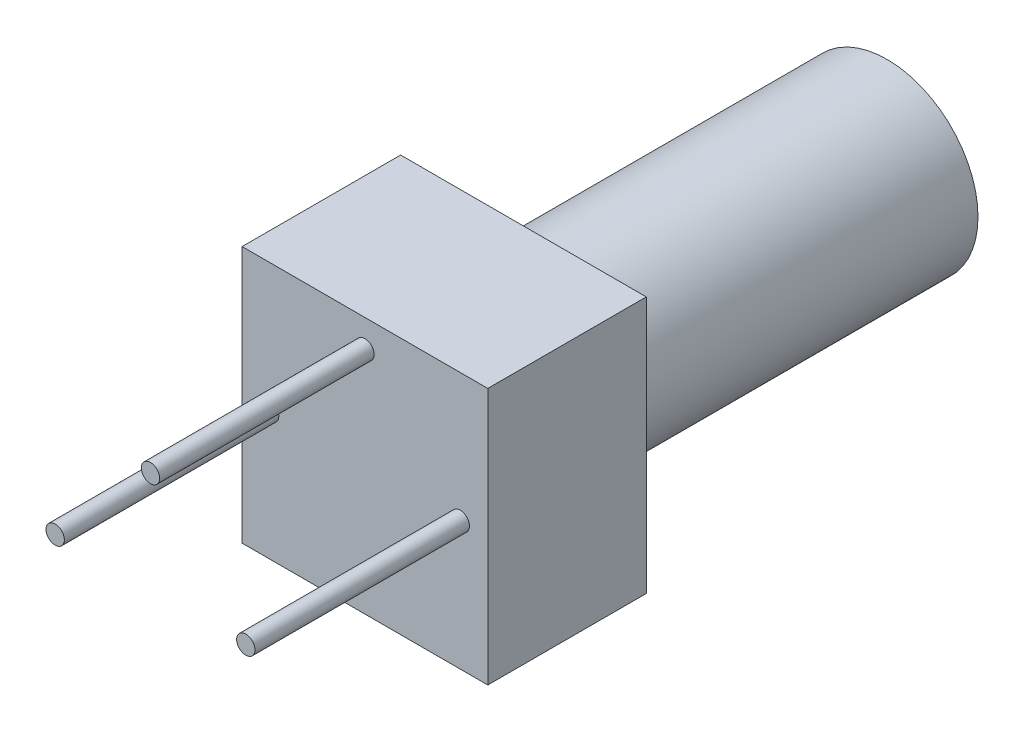
ISO-10303-21;
HEADER;
FILE_DESCRIPTION(('STEP AP214'),'2;1');
FILE_NAME('part.step','',(''),(''),'','','');
FILE_SCHEMA(('AUTOMOTIVE_DESIGN { 1 0 10303 214 1 1 1 1 }'));
ENDSEC;
DATA;
#1=APPLICATION_CONTEXT('core data for automotive mechanical design processes');
#2=APPLICATION_PROTOCOL_DEFINITION('international standard','automotive_design',2000,#1);
#3=PRODUCT_CONTEXT('',#1,'mechanical');
#4=PRODUCT('Part','Part','',(#3));
#5=PRODUCT_RELATED_PRODUCT_CATEGORY('part','',(#4));
#6=PRODUCT_DEFINITION_FORMATION('','',#4);
#7=PRODUCT_DEFINITION_CONTEXT('part definition',#1,'design');
#8=PRODUCT_DEFINITION('design','',#6,#7);
#9=PRODUCT_DEFINITION_SHAPE('','',#8);
#10=(LENGTH_UNIT() NAMED_UNIT(*) SI_UNIT(.MILLI.,.METRE.));
#11=(NAMED_UNIT(*) PLANE_ANGLE_UNIT() SI_UNIT($,.RADIAN.));
#12=(NAMED_UNIT(*) SI_UNIT($,.STERADIAN.) SOLID_ANGLE_UNIT());
#13=UNCERTAINTY_MEASURE_WITH_UNIT(LENGTH_MEASURE(1.E-05),#10,'distance_accuracy_value','');
#14=(GEOMETRIC_REPRESENTATION_CONTEXT(3) GLOBAL_UNCERTAINTY_ASSIGNED_CONTEXT((#13)) GLOBAL_UNIT_ASSIGNED_CONTEXT((#10,
#11,#12)) REPRESENTATION_CONTEXT('',''));
#15=CARTESIAN_POINT('',(0.,0.,0.));
#16=DIRECTION('',(0.,0.,1.));
#17=DIRECTION('',(1.,0.,0.));
#18=AXIS2_PLACEMENT_3D('',#15,#16,#17);
#19=CARTESIAN_POINT('',(2.59645,0.,48.66));
#20=DIRECTION('',(0.,0.,-1.));
#21=DIRECTION('',(-1.,0.,0.));
#22=AXIS2_PLACEMENT_3D('',#19,#20,#21);
#23=CYLINDRICAL_SURFACE('',#22,0.25);
#24=CARTESIAN_POINT('',(2.59645,0.,48.66));
#25=DIRECTION('',(0.,0.,-1.));
#26=DIRECTION('',(1.,0.,0.));
#27=AXIS2_PLACEMENT_3D('',#24,#25,#26);
#28=CIRCLE('',#27,0.25);
#29=CARTESIAN_POINT('',(2.84645,0.,48.66));
#30=VERTEX_POINT('',#29);
#31=EDGE_CURVE('E11',#30,#30,#28,.T.);
#32=ORIENTED_EDGE('',*,*,#31,.T.);
#33=EDGE_LOOP('',(#32));
#34=FACE_BOUND('',#33,.T.);
#35=CARTESIAN_POINT('',(2.59645,0.,42.818));
#36=DIRECTION('',(0.,0.,-1.));
#37=DIRECTION('',(1.,0.,0.));
#38=AXIS2_PLACEMENT_3D('',#35,#36,#37);
#39=CIRCLE('',#38,0.25);
#40=CARTESIAN_POINT('',(2.84645,0.,42.818));
#41=VERTEX_POINT('',#40);
#42=EDGE_CURVE('E43',#41,#41,#39,.T.);
#43=ORIENTED_EDGE('',*,*,#42,.F.);
#44=EDGE_LOOP('',(#43));
#45=FACE_BOUND('',#44,.T.);
#46=ADVANCED_FACE('F40',(#34,#45),#23,.T.);
#47=CARTESIAN_POINT('',(2.59645,0.,48.66));
#48=DIRECTION('',(0.,0.,1.));
#49=DIRECTION('',(1.,0.,0.));
#50=AXIS2_PLACEMENT_3D('',#47,#48,#49);
#51=PLANE('',#50);
#52=ORIENTED_EDGE('',*,*,#31,.F.);
#53=EDGE_LOOP('',(#52));
#54=FACE_BOUND('',#53,.T.);
#55=ADVANCED_FACE('F55',(#54),#51,.T.);
#56=CARTESIAN_POINT('',(2.59645,0.,42.818));
#57=DIRECTION('',(0.,0.,1.));
#58=DIRECTION('',(1.,0.,0.));
#59=AXIS2_PLACEMENT_3D('',#56,#57,#58);
#60=PLANE('',#59);
#61=ORIENTED_EDGE('',*,*,#42,.T.);
#62=EDGE_LOOP('',(#61));
#63=FACE_BOUND('',#62,.T.);
#64=ADVANCED_FACE('F52',(#63),#60,.F.);
#65=CLOSED_SHELL('',(#46,#55,#64));
#66=MANIFOLD_SOLID_BREP('B2',#65);
#67=CARTESIAN_POINT('',(-2.59645,0.,48.66));
#68=DIRECTION('',(0.,0.,-1.));
#69=DIRECTION('',(-1.,0.,0.));
#70=AXIS2_PLACEMENT_3D('',#67,#68,#69);
#71=CYLINDRICAL_SURFACE('',#70,0.25);
#72=CARTESIAN_POINT('',(-2.59645,0.,48.66));
#73=DIRECTION('',(0.,0.,-1.));
#74=DIRECTION('',(-1.,0.,0.));
#75=AXIS2_PLACEMENT_3D('',#72,#73,#74);
#76=CIRCLE('',#75,0.25);
#77=CARTESIAN_POINT('',(-2.84645,0.,48.66));
#78=VERTEX_POINT('',#77);
#79=EDGE_CURVE('E39',#78,#78,#76,.T.);
#80=ORIENTED_EDGE('',*,*,#79,.T.);
#81=EDGE_LOOP('',(#80));
#82=FACE_BOUND('',#81,.T.);
#83=CARTESIAN_POINT('',(-2.59645,0.,42.818));
#84=DIRECTION('',(0.,0.,-1.));
#85=DIRECTION('',(-1.,0.,0.));
#86=AXIS2_PLACEMENT_3D('',#83,#84,#85);
#87=CIRCLE('',#86,0.25);
#88=CARTESIAN_POINT('',(-2.84645,0.,42.818));
#89=VERTEX_POINT('',#88);
#90=EDGE_CURVE('E92',#89,#89,#87,.T.);
#91=ORIENTED_EDGE('',*,*,#90,.F.);
#92=EDGE_LOOP('',(#91));
#93=FACE_BOUND('',#92,.T.);
#94=ADVANCED_FACE('F89',(#82,#93),#71,.T.);
#95=CARTESIAN_POINT('',(-2.59645,0.,48.66));
#96=DIRECTION('',(0.,0.,-1.));
#97=DIRECTION('',(-1.,0.,0.));
#98=AXIS2_PLACEMENT_3D('',#95,#96,#97);
#99=PLANE('',#98);
#100=ORIENTED_EDGE('',*,*,#79,.F.);
#101=EDGE_LOOP('',(#100));
#102=FACE_BOUND('',#101,.T.);
#103=ADVANCED_FACE('F104',(#102),#99,.F.);
#104=CARTESIAN_POINT('',(-2.59645,0.,42.818));
#105=DIRECTION('',(0.,0.,-1.));
#106=DIRECTION('',(-1.,0.,0.));
#107=AXIS2_PLACEMENT_3D('',#104,#105,#106);
#108=PLANE('',#107);
#109=ORIENTED_EDGE('',*,*,#90,.T.);
#110=EDGE_LOOP('',(#109));
#111=FACE_BOUND('',#110,.T.);
#112=ADVANCED_FACE('F101',(#111),#108,.T.);
#113=CLOSED_SHELL('',(#94,#103,#112));
#114=MANIFOLD_SOLID_BREP('B6',#113);
#115=CARTESIAN_POINT('',(0.,2.74885,48.66));
#116=DIRECTION('',(0.,0.,-1.));
#117=DIRECTION('',(-1.,0.,0.));
#118=AXIS2_PLACEMENT_3D('',#115,#116,#117);
#119=CYLINDRICAL_SURFACE('',#118,0.25);
#120=CARTESIAN_POINT('',(0.,2.74885,48.66));
#121=DIRECTION('',(0.,0.,-1.));
#122=DIRECTION('',(-1.,0.,0.));
#123=AXIS2_PLACEMENT_3D('',#120,#121,#122);
#124=CIRCLE('',#123,0.25);
#125=CARTESIAN_POINT('',(-0.25,2.74885,48.66));
#126=VERTEX_POINT('',#125);
#127=EDGE_CURVE('E88',#126,#126,#124,.T.);
#128=ORIENTED_EDGE('',*,*,#127,.T.);
#129=EDGE_LOOP('',(#128));
#130=FACE_BOUND('',#129,.T.);
#131=CARTESIAN_POINT('',(0.,2.74885,42.818));
#132=DIRECTION('',(0.,0.,-1.));
#133=DIRECTION('',(-1.,0.,0.));
#134=AXIS2_PLACEMENT_3D('',#131,#132,#133);
#135=CIRCLE('',#134,0.25);
#136=CARTESIAN_POINT('',(-0.25,2.74885,42.818));
#137=VERTEX_POINT('',#136);
#138=EDGE_CURVE('E142',#137,#137,#135,.T.);
#139=ORIENTED_EDGE('',*,*,#138,.F.);
#140=EDGE_LOOP('',(#139));
#141=FACE_BOUND('',#140,.T.);
#142=ADVANCED_FACE('F139',(#130,#141),#119,.T.);
#143=CARTESIAN_POINT('',(0.,2.74885,48.66));
#144=DIRECTION('',(0.,0.,-1.));
#145=DIRECTION('',(-1.,0.,0.));
#146=AXIS2_PLACEMENT_3D('',#143,#144,#145);
#147=PLANE('',#146);
#148=ORIENTED_EDGE('',*,*,#127,.F.);
#149=EDGE_LOOP('',(#148));
#150=FACE_BOUND('',#149,.T.);
#151=ADVANCED_FACE('F154',(#150),#147,.F.);
#152=CARTESIAN_POINT('',(0.,2.74885,42.818));
#153=DIRECTION('',(0.,0.,-1.));
#154=DIRECTION('',(-1.,0.,0.));
#155=AXIS2_PLACEMENT_3D('',#152,#153,#154);
#156=PLANE('',#155);
#157=ORIENTED_EDGE('',*,*,#138,.T.);
#158=EDGE_LOOP('',(#157));
#159=FACE_BOUND('',#158,.T.);
#160=ADVANCED_FACE('F151',(#159),#156,.T.);
#161=CLOSED_SHELL('',(#142,#151,#160));
#162=MANIFOLD_SOLID_BREP('B34',#161);
#163=CARTESIAN_POINT('',(3.34645,-3.49885,42.818));
#164=DIRECTION('',(-1.,0.,0.));
#165=DIRECTION('',(0.,0.,1.));
#166=AXIS2_PLACEMENT_3D('',#163,#164,#165);
#167=PLANE('',#166);
#168=DIRECTION('',(0.,1.,0.));
#169=VECTOR('',#168,1.);
#170=CARTESIAN_POINT('',(3.34645,-3.49885,38.5));
#171=LINE('',#170,#169);
#172=CARTESIAN_POINT('',(3.34645,-3.49885,38.5));
#173=VERTEX_POINT('',#172);
#174=CARTESIAN_POINT('',(3.34645,3.49885,38.5));
#175=VERTEX_POINT('',#174);
#176=EDGE_CURVE('E336',#173,#175,#171,.T.);
#177=ORIENTED_EDGE('',*,*,#176,.T.);
#178=DIRECTION('',(0.,0.,-1.));
#179=VECTOR('',#178,1.);
#180=CARTESIAN_POINT('',(3.34645,3.49885,42.818));
#181=LINE('',#180,#179);
#182=CARTESIAN_POINT('',(3.34645,3.49885,42.818));
#183=VERTEX_POINT('',#182);
#184=EDGE_CURVE('E137',#183,#175,#181,.T.);
#185=ORIENTED_EDGE('',*,*,#184,.F.);
#186=DIRECTION('',(0.,1.,0.));
#187=VECTOR('',#186,1.);
#188=CARTESIAN_POINT('',(3.34645,-3.49885,42.818));
#189=LINE('',#188,#187);
#190=CARTESIAN_POINT('',(3.34645,-3.49885,42.818));
#191=VERTEX_POINT('',#190);
#192=EDGE_CURVE('E339',#191,#183,#189,.T.);
#193=ORIENTED_EDGE('',*,*,#192,.F.);
#194=DIRECTION('',(0.,0.,-1.));
#195=VECTOR('',#194,1.);
#196=CARTESIAN_POINT('',(3.34645,-3.49885,42.818));
#197=LINE('',#196,#195);
#198=EDGE_CURVE('E203',#191,#173,#197,.T.);
#199=ORIENTED_EDGE('',*,*,#198,.T.);
#200=EDGE_LOOP('',(#177,#185,#193,#199));
#201=FACE_BOUND('',#200,.T.);
#202=ADVANCED_FACE('F180',(#201),#167,.F.);
#203=CARTESIAN_POINT('',(3.34645,3.49885,42.818));
#204=DIRECTION('',(0.,-1.,0.));
#205=DIRECTION('',(1.,0.,0.));
#206=AXIS2_PLACEMENT_3D('',#203,#204,#205);
#207=PLANE('',#206);
#208=DIRECTION('',(-1.,0.,0.));
#209=VECTOR('',#208,1.);
#210=CARTESIAN_POINT('',(3.34645,3.49885,38.5));
#211=LINE('',#210,#209);
#212=CARTESIAN_POINT('',(-3.34645,3.49885,38.5));
#213=VERTEX_POINT('',#212);
#214=EDGE_CURVE('E349',#175,#213,#211,.T.);
#215=ORIENTED_EDGE('',*,*,#214,.T.);
#216=DIRECTION('',(0.,0.,-1.));
#217=VECTOR('',#216,1.);
#218=CARTESIAN_POINT('',(-3.34645,3.49885,42.818));
#219=LINE('',#218,#217);
#220=CARTESIAN_POINT('',(-3.34645,3.49885,42.818));
#221=VERTEX_POINT('',#220);
#222=EDGE_CURVE('E187',#221,#213,#219,.T.);
#223=ORIENTED_EDGE('',*,*,#222,.F.);
#224=DIRECTION('',(-1.,0.,0.));
#225=VECTOR('',#224,1.);
#226=CARTESIAN_POINT('',(3.34645,3.49885,42.818));
#227=LINE('',#226,#225);
#228=EDGE_CURVE('E229',#183,#221,#227,.T.);
#229=ORIENTED_EDGE('',*,*,#228,.F.);
#230=ORIENTED_EDGE('',*,*,#184,.T.);
#231=EDGE_LOOP('',(#215,#223,#229,#230));
#232=FACE_BOUND('',#231,.T.);
#233=ADVANCED_FACE('F363',(#232),#207,.F.);
#234=CARTESIAN_POINT('',(-3.34645,-3.49885,42.818));
#235=DIRECTION('',(-1.,0.,0.));
#236=DIRECTION('',(0.,0.,1.));
#237=AXIS2_PLACEMENT_3D('',#234,#235,#236);
#238=PLANE('',#237);
#239=DIRECTION('',(0.,1.,0.));
#240=VECTOR('',#239,1.);
#241=CARTESIAN_POINT('',(-3.34645,-3.49885,38.5));
#242=LINE('',#241,#240);
#243=CARTESIAN_POINT('',(-3.34645,-3.49885,38.5));
#244=VERTEX_POINT('',#243);
#245=EDGE_CURVE('E352',#244,#213,#242,.T.);
#246=ORIENTED_EDGE('',*,*,#245,.F.);
#247=DIRECTION('',(0.,0.,-1.));
#248=VECTOR('',#247,1.);
#249=CARTESIAN_POINT('',(-3.34645,-3.49885,42.818));
#250=LINE('',#249,#248);
#251=CARTESIAN_POINT('',(-3.34645,-3.49885,42.818));
#252=VERTEX_POINT('',#251);
#253=EDGE_CURVE('E358',#252,#244,#250,.T.);
#254=ORIENTED_EDGE('',*,*,#253,.F.);
#255=DIRECTION('',(0.,1.,0.));
#256=VECTOR('',#255,1.);
#257=CARTESIAN_POINT('',(-3.34645,-3.49885,42.818));
#258=LINE('',#257,#256);
#259=EDGE_CURVE('E343',#252,#221,#258,.T.);
#260=ORIENTED_EDGE('',*,*,#259,.T.);
#261=ORIENTED_EDGE('',*,*,#222,.T.);
#262=EDGE_LOOP('',(#246,#254,#260,#261));
#263=FACE_BOUND('',#262,.T.);
#264=ADVANCED_FACE('F361',(#263),#238,.T.);
#265=CARTESIAN_POINT('',(3.34645,-3.49885,42.818));
#266=DIRECTION('',(0.,-1.,0.));
#267=DIRECTION('',(1.,0.,0.));
#268=AXIS2_PLACEMENT_3D('',#265,#266,#267);
#269=PLANE('',#268);
#270=DIRECTION('',(-1.,0.,0.));
#271=VECTOR('',#270,1.);
#272=CARTESIAN_POINT('',(3.34645,-3.49885,38.5));
#273=LINE('',#272,#271);
#274=EDGE_CURVE('E341',#173,#244,#273,.T.);
#275=ORIENTED_EDGE('',*,*,#274,.F.);
#276=ORIENTED_EDGE('',*,*,#198,.F.);
#277=DIRECTION('',(-1.,0.,0.));
#278=VECTOR('',#277,1.);
#279=CARTESIAN_POINT('',(3.34645,-3.49885,42.818));
#280=LINE('',#279,#278);
#281=EDGE_CURVE('E346',#191,#252,#280,.T.);
#282=ORIENTED_EDGE('',*,*,#281,.T.);
#283=ORIENTED_EDGE('',*,*,#253,.T.);
#284=EDGE_LOOP('',(#275,#276,#282,#283));
#285=FACE_BOUND('',#284,.T.);
#286=ADVANCED_FACE('F367',(#285),#269,.T.);
#287=CARTESIAN_POINT('',(0.,0.,42.818));
#288=DIRECTION('',(0.,0.,1.));
#289=DIRECTION('',(1.,0.,0.));
#290=AXIS2_PLACEMENT_3D('',#287,#288,#289);
#291=PLANE('',#290);
#292=ORIENTED_EDGE('',*,*,#192,.T.);
#293=ORIENTED_EDGE('',*,*,#228,.T.);
#294=ORIENTED_EDGE('',*,*,#259,.F.);
#295=ORIENTED_EDGE('',*,*,#281,.F.);
#296=EDGE_LOOP('',(#292,#293,#294,#295));
#297=FACE_BOUND('',#296,.T.);
#298=ADVANCED_FACE('F370',(#297),#291,.T.);
#299=CARTESIAN_POINT('',(0.,0.,38.5));
#300=DIRECTION('',(0.,0.,1.));
#301=DIRECTION('',(1.,0.,0.));
#302=AXIS2_PLACEMENT_3D('',#299,#300,#301);
#303=PLANE('',#302);
#304=CARTESIAN_POINT('',(0.,0.,38.5));
#305=DIRECTION('',(0.,0.,1.));
#306=DIRECTION('',(1.,0.,0.));
#307=AXIS2_PLACEMENT_3D('',#304,#305,#306);
#308=CIRCLE('',#307,2.4765);
#309=CARTESIAN_POINT('',(2.4765,0.,38.5));
#310=VERTEX_POINT('',#309);
#311=EDGE_CURVE('E323',#310,#310,#308,.T.);
#312=ORIENTED_EDGE('',*,*,#311,.T.);
#313=EDGE_LOOP('',(#312));
#314=FACE_BOUND('',#313,.T.);
#315=ORIENTED_EDGE('',*,*,#176,.F.);
#316=ORIENTED_EDGE('',*,*,#274,.T.);
#317=ORIENTED_EDGE('',*,*,#245,.T.);
#318=ORIENTED_EDGE('',*,*,#214,.F.);
#319=EDGE_LOOP('',(#315,#316,#317,#318));
#320=FACE_BOUND('',#319,.T.);
#321=ADVANCED_FACE('F366',(#314,#320),#303,.F.);
#322=CARTESIAN_POINT('',(0.,0.,28.594));
#323=DIRECTION('',(0.,0.,1.));
#324=DIRECTION('',(1.,0.,0.));
#325=AXIS2_PLACEMENT_3D('',#322,#323,#324);
#326=CYLINDRICAL_SURFACE('',#325,2.4765);
#327=CARTESIAN_POINT('',(0.,0.,28.594));
#328=DIRECTION('',(0.,0.,1.));
#329=DIRECTION('',(1.,0.,0.));
#330=AXIS2_PLACEMENT_3D('',#327,#328,#329);
#331=CIRCLE('',#330,2.4765);
#332=CARTESIAN_POINT('',(2.4765,0.,28.594));
#333=VERTEX_POINT('',#332);
#334=EDGE_CURVE('E333',#333,#333,#331,.T.);
#335=ORIENTED_EDGE('',*,*,#334,.T.);
#336=EDGE_LOOP('',(#335));
#337=FACE_BOUND('',#336,.T.);
#338=ORIENTED_EDGE('',*,*,#311,.F.);
#339=EDGE_LOOP('',(#338));
#340=FACE_BOUND('',#339,.T.);
#341=ADVANCED_FACE('F384',(#337,#340),#326,.T.);
#342=CARTESIAN_POINT('',(0.,0.,28.594));
#343=DIRECTION('',(0.,0.,1.));
#344=DIRECTION('',(1.,0.,0.));
#345=AXIS2_PLACEMENT_3D('',#342,#343,#344);
#346=PLANE('',#345);
#347=DIRECTION('',(0.554700196225229,-0.832050294337843,0.));
#348=VECTOR('',#347,1.);
#349=CARTESIAN_POINT('',(0.,1.5,28.594));
#350=LINE('',#349,#348);
#351=CARTESIAN_POINT('',(0.,1.5,28.594));
#352=VERTEX_POINT('',#351);
#353=CARTESIAN_POINT('',(0.5,0.75,28.594));
#354=VERTEX_POINT('',#353);
#355=EDGE_CURVE('E308',#352,#354,#350,.T.);
#356=ORIENTED_EDGE('',*,*,#355,.F.);
#357=DIRECTION('',(0.554700196225229,0.832050294337843,0.));
#358=VECTOR('',#357,1.);
#359=CARTESIAN_POINT('',(0.,1.5,28.594));
#360=LINE('',#359,#358);
#361=CARTESIAN_POINT('',(-0.5,0.75,28.594));
#362=VERTEX_POINT('',#361);
#363=EDGE_CURVE('E194',#362,#352,#360,.T.);
#364=ORIENTED_EDGE('',*,*,#363,.F.);
#365=DIRECTION('',(-1.,0.,0.));
#366=VECTOR('',#365,1.);
#367=CARTESIAN_POINT('',(-0.5,0.75,28.594));
#368=LINE('',#367,#366);
#369=CARTESIAN_POINT('',(-0.25,0.75,28.594));
#370=VERTEX_POINT('',#369);
#371=EDGE_CURVE('E291',#370,#362,#368,.T.);
#372=ORIENTED_EDGE('',*,*,#371,.F.);
#373=DIRECTION('',(0.,1.,0.));
#374=VECTOR('',#373,1.);
#375=CARTESIAN_POINT('',(-0.25,0.75,28.594));
#376=LINE('',#375,#374);
#377=CARTESIAN_POINT('',(-0.25,-1.5,28.594));
#378=VERTEX_POINT('',#377);
#379=EDGE_CURVE('E294',#378,#370,#376,.T.);
#380=ORIENTED_EDGE('',*,*,#379,.F.);
#381=DIRECTION('',(-1.,0.,0.));
#382=VECTOR('',#381,1.);
#383=CARTESIAN_POINT('',(0.25,-1.5,28.594));
#384=LINE('',#383,#382);
#385=CARTESIAN_POINT('',(0.25,-1.5,28.594));
#386=VERTEX_POINT('',#385);
#387=EDGE_CURVE('E316',#386,#378,#384,.T.);
#388=ORIENTED_EDGE('',*,*,#387,.F.);
#389=DIRECTION('',(0.,-1.,0.));
#390=VECTOR('',#389,1.);
#391=CARTESIAN_POINT('',(0.25,0.75,28.594));
#392=LINE('',#391,#390);
#393=CARTESIAN_POINT('',(0.25,0.75,28.594));
#394=VERTEX_POINT('',#393);
#395=EDGE_CURVE('E313',#394,#386,#392,.T.);
#396=ORIENTED_EDGE('',*,*,#395,.F.);
#397=DIRECTION('',(-1.,0.,0.));
#398=VECTOR('',#397,1.);
#399=CARTESIAN_POINT('',(0.5,0.75,28.594));
#400=LINE('',#399,#398);
#401=EDGE_CURVE('E310',#354,#394,#400,.T.);
#402=ORIENTED_EDGE('',*,*,#401,.F.);
#403=EDGE_LOOP('',(#356,#364,#372,#380,#388,#396,#402));
#404=FACE_BOUND('',#403,.T.);
#405=ORIENTED_EDGE('',*,*,#334,.F.);
#406=EDGE_LOOP('',(#405));
#407=FACE_BOUND('',#406,.T.);
#408=ADVANCED_FACE('F390',(#404,#407),#346,.F.);
#409=CARTESIAN_POINT('',(0.,1.5,29.094));
#410=DIRECTION('',(-0.832050294337844,0.554700196225229,0.));
#411=DIRECTION('',(-0.554700196225229,-0.832050294337844,0.));
#412=AXIS2_PLACEMENT_3D('',#409,#410,#411);
#413=PLANE('',#412);
#414=ORIENTED_EDGE('',*,*,#363,.T.);
#415=DIRECTION('',(0.,0.,-1.));
#416=VECTOR('',#415,1.);
#417=CARTESIAN_POINT('',(0.,1.5,29.094));
#418=LINE('',#417,#416);
#419=CARTESIAN_POINT('',(0.,1.5,29.094));
#420=VERTEX_POINT('',#419);
#421=EDGE_CURVE('E268',#420,#352,#418,.T.);
#422=ORIENTED_EDGE('',*,*,#421,.F.);
#423=DIRECTION('',(0.554700196225229,0.832050294337843,0.));
#424=VECTOR('',#423,1.);
#425=CARTESIAN_POINT('',(0.,1.5,29.094));
#426=LINE('',#425,#424);
#427=CARTESIAN_POINT('',(-0.5,0.75,29.094));
#428=VERTEX_POINT('',#427);
#429=EDGE_CURVE('E272',#428,#420,#426,.T.);
#430=ORIENTED_EDGE('',*,*,#429,.F.);
#431=DIRECTION('',(0.,0.,-1.));
#432=VECTOR('',#431,1.);
#433=CARTESIAN_POINT('',(-0.5,0.75,29.094));
#434=LINE('',#433,#432);
#435=EDGE_CURVE('E321',#428,#362,#434,.T.);
#436=ORIENTED_EDGE('',*,*,#435,.T.);
#437=EDGE_LOOP('',(#414,#422,#430,#436));
#438=FACE_BOUND('',#437,.T.);
#439=ADVANCED_FACE('F270',(#438),#413,.F.);
#440=CARTESIAN_POINT('',(-0.5,0.75,29.094));
#441=DIRECTION('',(0.,-1.,0.));
#442=DIRECTION('',(0.,0.,-1.));
#443=AXIS2_PLACEMENT_3D('',#440,#441,#442);
#444=PLANE('',#443);
#445=ORIENTED_EDGE('',*,*,#371,.T.);
#446=ORIENTED_EDGE('',*,*,#435,.F.);
#447=DIRECTION('',(-1.,0.,0.));
#448=VECTOR('',#447,1.);
#449=CARTESIAN_POINT('',(-0.5,0.75,29.094));
#450=LINE('',#449,#448);
#451=CARTESIAN_POINT('',(-0.25,0.75,29.094));
#452=VERTEX_POINT('',#451);
#453=EDGE_CURVE('E278',#452,#428,#450,.T.);
#454=ORIENTED_EDGE('',*,*,#453,.F.);
#455=DIRECTION('',(0.,0.,-1.));
#456=VECTOR('',#455,1.);
#457=CARTESIAN_POINT('',(-0.25,0.75,29.094));
#458=LINE('',#457,#456);
#459=EDGE_CURVE('E324',#452,#370,#458,.T.);
#460=ORIENTED_EDGE('',*,*,#459,.T.);
#461=EDGE_LOOP('',(#445,#446,#454,#460));
#462=FACE_BOUND('',#461,.T.);
#463=ADVANCED_FACE('F397',(#462),#444,.F.);
#464=CARTESIAN_POINT('',(-0.25,0.75,29.094));
#465=DIRECTION('',(-1.,0.,0.));
#466=DIRECTION('',(0.,-1.,0.));
#467=AXIS2_PLACEMENT_3D('',#464,#465,#466);
#468=PLANE('',#467);
#469=ORIENTED_EDGE('',*,*,#379,.T.);
#470=ORIENTED_EDGE('',*,*,#459,.F.);
#471=DIRECTION('',(0.,1.,0.));
#472=VECTOR('',#471,1.);
#473=CARTESIAN_POINT('',(-0.25,0.75,29.094));
#474=LINE('',#473,#472);
#475=CARTESIAN_POINT('',(-0.25,-1.5,29.094));
#476=VERTEX_POINT('',#475);
#477=EDGE_CURVE('E304',#476,#452,#474,.T.);
#478=ORIENTED_EDGE('',*,*,#477,.F.);
#479=DIRECTION('',(0.,0.,-1.));
#480=VECTOR('',#479,1.);
#481=CARTESIAN_POINT('',(-0.25,-1.5,29.094));
#482=LINE('',#481,#480);
#483=EDGE_CURVE('E326',#476,#378,#482,.T.);
#484=ORIENTED_EDGE('',*,*,#483,.T.);
#485=EDGE_LOOP('',(#469,#470,#478,#484));
#486=FACE_BOUND('',#485,.T.);
#487=ADVANCED_FACE('F411',(#486),#468,.F.);
#488=CARTESIAN_POINT('',(0.25,-1.5,29.094));
#489=DIRECTION('',(0.,-1.,0.));
#490=DIRECTION('',(0.,0.,-1.));
#491=AXIS2_PLACEMENT_3D('',#488,#489,#490);
#492=PLANE('',#491);
#493=ORIENTED_EDGE('',*,*,#387,.T.);
#494=ORIENTED_EDGE('',*,*,#483,.F.);
#495=DIRECTION('',(-1.,0.,0.));
#496=VECTOR('',#495,1.);
#497=CARTESIAN_POINT('',(0.25,-1.5,29.094));
#498=LINE('',#497,#496);
#499=CARTESIAN_POINT('',(0.25,-1.5,29.094));
#500=VERTEX_POINT('',#499);
#501=EDGE_CURVE('E301',#500,#476,#498,.T.);
#502=ORIENTED_EDGE('',*,*,#501,.F.);
#503=DIRECTION('',(0.,0.,-1.));
#504=VECTOR('',#503,1.);
#505=CARTESIAN_POINT('',(0.25,-1.5,29.094));
#506=LINE('',#505,#504);
#507=EDGE_CURVE('E328',#500,#386,#506,.T.);
#508=ORIENTED_EDGE('',*,*,#507,.T.);
#509=EDGE_LOOP('',(#493,#494,#502,#508));
#510=FACE_BOUND('',#509,.T.);
#511=ADVANCED_FACE('F407',(#510),#492,.F.);
#512=CARTESIAN_POINT('',(0.25,0.75,29.094));
#513=DIRECTION('',(1.,0.,0.));
#514=DIRECTION('',(0.,1.,0.));
#515=AXIS2_PLACEMENT_3D('',#512,#513,#514);
#516=PLANE('',#515);
#517=ORIENTED_EDGE('',*,*,#395,.T.);
#518=ORIENTED_EDGE('',*,*,#507,.F.);
#519=DIRECTION('',(0.,-1.,0.));
#520=VECTOR('',#519,1.);
#521=CARTESIAN_POINT('',(0.25,0.75,29.094));
#522=LINE('',#521,#520);
#523=CARTESIAN_POINT('',(0.25,0.75,29.094));
#524=VERTEX_POINT('',#523);
#525=EDGE_CURVE('E298',#524,#500,#522,.T.);
#526=ORIENTED_EDGE('',*,*,#525,.F.);
#527=DIRECTION('',(0.,0.,-1.));
#528=VECTOR('',#527,1.);
#529=CARTESIAN_POINT('',(0.25,0.75,29.094));
#530=LINE('',#529,#528);
#531=EDGE_CURVE('E330',#524,#394,#530,.T.);
#532=ORIENTED_EDGE('',*,*,#531,.T.);
#533=EDGE_LOOP('',(#517,#518,#526,#532));
#534=FACE_BOUND('',#533,.T.);
#535=ADVANCED_FACE('F403',(#534),#516,.F.);
#536=CARTESIAN_POINT('',(0.5,0.75,29.094));
#537=DIRECTION('',(0.,-1.,0.));
#538=DIRECTION('',(0.,0.,-1.));
#539=AXIS2_PLACEMENT_3D('',#536,#537,#538);
#540=PLANE('',#539);
#541=ORIENTED_EDGE('',*,*,#401,.T.);
#542=ORIENTED_EDGE('',*,*,#531,.F.);
#543=DIRECTION('',(-1.,0.,0.));
#544=VECTOR('',#543,1.);
#545=CARTESIAN_POINT('',(0.5,0.75,29.094));
#546=LINE('',#545,#544);
#547=CARTESIAN_POINT('',(0.5,0.75,29.094));
#548=VERTEX_POINT('',#547);
#549=EDGE_CURVE('E286',#548,#524,#546,.T.);
#550=ORIENTED_EDGE('',*,*,#549,.F.);
#551=DIRECTION('',(0.,0.,-1.));
#552=VECTOR('',#551,1.);
#553=CARTESIAN_POINT('',(0.5,0.75,29.094));
#554=LINE('',#553,#552);
#555=EDGE_CURVE('E277',#548,#354,#554,.T.);
#556=ORIENTED_EDGE('',*,*,#555,.T.);
#557=EDGE_LOOP('',(#541,#542,#550,#556));
#558=FACE_BOUND('',#557,.T.);
#559=ADVANCED_FACE('F400',(#558),#540,.F.);
#560=CARTESIAN_POINT('',(0.,1.5,29.094));
#561=DIRECTION('',(0.832050294337844,0.554700196225229,0.));
#562=DIRECTION('',(-0.554700196225229,0.832050294337844,0.));
#563=AXIS2_PLACEMENT_3D('',#560,#561,#562);
#564=PLANE('',#563);
#565=ORIENTED_EDGE('',*,*,#355,.T.);
#566=ORIENTED_EDGE('',*,*,#555,.F.);
#567=DIRECTION('',(0.554700196225229,-0.832050294337843,0.));
#568=VECTOR('',#567,1.);
#569=CARTESIAN_POINT('',(0.,1.5,29.094));
#570=LINE('',#569,#568);
#571=EDGE_CURVE('E281',#420,#548,#570,.T.);
#572=ORIENTED_EDGE('',*,*,#571,.F.);
#573=ORIENTED_EDGE('',*,*,#421,.T.);
#574=EDGE_LOOP('',(#565,#566,#572,#573));
#575=FACE_BOUND('',#574,.T.);
#576=ADVANCED_FACE('F282',(#575),#564,.F.);
#577=CARTESIAN_POINT('',(0.,0.,29.094));
#578=DIRECTION('',(0.,0.,1.));
#579=DIRECTION('',(1.,0.,0.));
#580=AXIS2_PLACEMENT_3D('',#577,#578,#579);
#581=PLANE('',#580);
#582=ORIENTED_EDGE('',*,*,#429,.T.);
#583=ORIENTED_EDGE('',*,*,#571,.T.);
#584=ORIENTED_EDGE('',*,*,#549,.T.);
#585=ORIENTED_EDGE('',*,*,#525,.T.);
#586=ORIENTED_EDGE('',*,*,#501,.T.);
#587=ORIENTED_EDGE('',*,*,#477,.T.);
#588=ORIENTED_EDGE('',*,*,#453,.T.);
#589=EDGE_LOOP('',(#582,#583,#584,#585,#586,#587,#588));
#590=FACE_BOUND('',#589,.T.);
#591=ADVANCED_FACE('F288',(#590),#581,.F.);
#592=CLOSED_SHELL('',(#202,#233,#264,#286,#298,#321,#341,#408,#439,#463,#487,#511,#535,#559,
#576,#591));
#593=MANIFOLD_SOLID_BREP('B83',#592);
#594=ADVANCED_BREP_SHAPE_REPRESENTATION('',(#18,#66,#114,#162,#593),#14);
#595=SHAPE_DEFINITION_REPRESENTATION(#9,#594);
ENDSEC;
END-ISO-10303-21;
